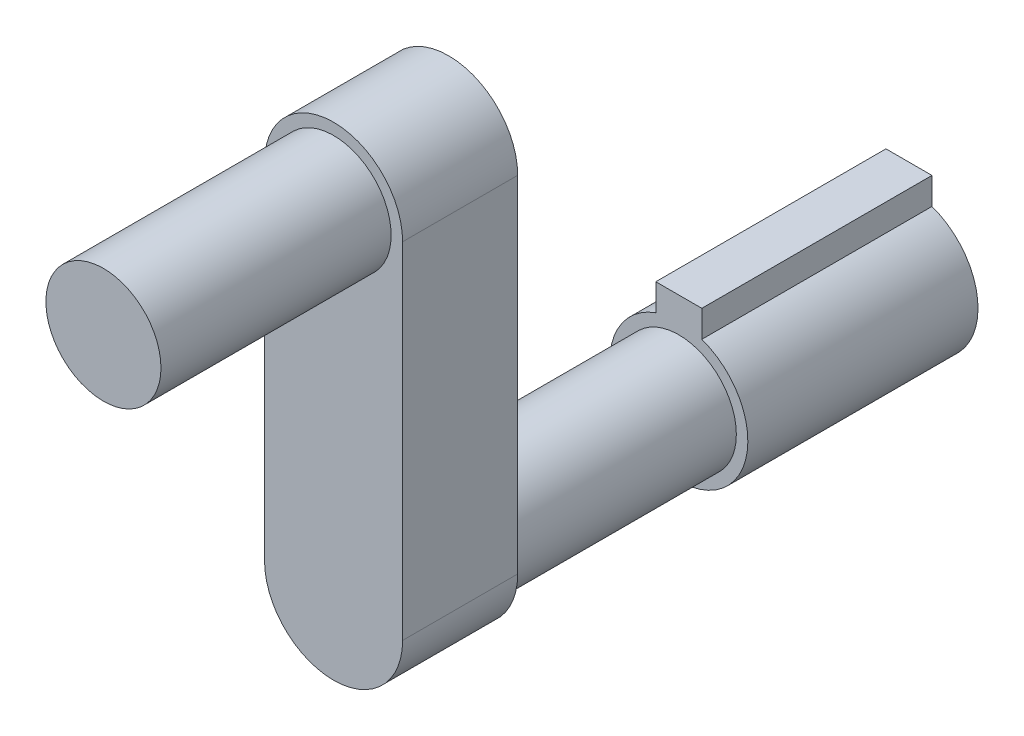
ISO-10303-21;
HEADER;
FILE_DESCRIPTION(('STEP AP214'),'2;1');
FILE_NAME('part.step','',(''),(''),'','','');
FILE_SCHEMA(('AUTOMOTIVE_DESIGN { 1 0 10303 214 1 1 1 1 }'));
ENDSEC;
DATA;
#1=APPLICATION_CONTEXT('core data for automotive mechanical design processes');
#2=APPLICATION_PROTOCOL_DEFINITION('international standard','automotive_design',2000,#1);
#3=PRODUCT_CONTEXT('',#1,'mechanical');
#4=PRODUCT('Part','Part','',(#3));
#5=PRODUCT_RELATED_PRODUCT_CATEGORY('part','',(#4));
#6=PRODUCT_DEFINITION_FORMATION('','',#4);
#7=PRODUCT_DEFINITION_CONTEXT('part definition',#1,'design');
#8=PRODUCT_DEFINITION('design','',#6,#7);
#9=PRODUCT_DEFINITION_SHAPE('','',#8);
#10=(LENGTH_UNIT() NAMED_UNIT(*) SI_UNIT(.MILLI.,.METRE.));
#11=(NAMED_UNIT(*) PLANE_ANGLE_UNIT() SI_UNIT($,.RADIAN.));
#12=(NAMED_UNIT(*) SI_UNIT($,.STERADIAN.) SOLID_ANGLE_UNIT());
#13=UNCERTAINTY_MEASURE_WITH_UNIT(LENGTH_MEASURE(1.E-05),#10,'distance_accuracy_value','');
#14=(GEOMETRIC_REPRESENTATION_CONTEXT(3) GLOBAL_UNCERTAINTY_ASSIGNED_CONTEXT((#13)) GLOBAL_UNIT_ASSIGNED_CONTEXT((#10,
#11,#12)) REPRESENTATION_CONTEXT('',''));
#15=CARTESIAN_POINT('',(0.,0.,0.));
#16=DIRECTION('',(0.,0.,1.));
#17=DIRECTION('',(1.,0.,0.));
#18=AXIS2_PLACEMENT_3D('',#15,#16,#17);
#19=CARTESIAN_POINT('',(0.,0.,0.));
#20=DIRECTION('',(0.,0.,1.));
#21=DIRECTION('',(1.,0.,0.));
#22=AXIS2_PLACEMENT_3D('',#19,#20,#21);
#23=PLANE('',#22);
#24=CARTESIAN_POINT('',(0.,0.,0.));
#25=DIRECTION('',(0.,0.,1.));
#26=DIRECTION('',(1.,0.,0.));
#27=AXIS2_PLACEMENT_3D('',#24,#25,#26);
#28=CIRCLE('',#27,3.);
#29=CARTESIAN_POINT('',(-1.,2.82842712474619,0.));
#30=VERTEX_POINT('',#29);
#31=CARTESIAN_POINT('',(1.,2.82842712474619,0.));
#32=VERTEX_POINT('',#31);
#33=EDGE_CURVE('E97',#30,#32,#28,.T.);
#34=ORIENTED_EDGE('',*,*,#33,.F.);
#35=DIRECTION('',(0.,1.,0.));
#36=VECTOR('',#35,1.);
#37=CARTESIAN_POINT('',(-1.,0.,0.));
#38=LINE('',#37,#36);
#39=CARTESIAN_POINT('',(-1.,3.99679871897497,0.));
#40=VERTEX_POINT('',#39);
#41=EDGE_CURVE('E202',#30,#40,#38,.T.);
#42=ORIENTED_EDGE('',*,*,#41,.T.);
#43=DIRECTION('',(-1.,0.,0.));
#44=VECTOR('',#43,1.);
#45=CARTESIAN_POINT('',(0.,3.99679871897497,0.));
#46=LINE('',#45,#44);
#47=CARTESIAN_POINT('',(1.,3.99679871897497,0.));
#48=VERTEX_POINT('',#47);
#49=EDGE_CURVE('E208',#48,#40,#46,.T.);
#50=ORIENTED_EDGE('',*,*,#49,.F.);
#51=DIRECTION('',(0.,1.,0.));
#52=VECTOR('',#51,1.);
#53=CARTESIAN_POINT('',(1.,0.,0.));
#54=LINE('',#53,#52);
#55=EDGE_CURVE('E206',#32,#48,#54,.T.);
#56=ORIENTED_EDGE('',*,*,#55,.F.);
#57=EDGE_LOOP('',(#34,#42,#50,#56));
#58=FACE_BOUND('',#57,.T.);
#59=ADVANCED_FACE('F93',(#58),#23,.F.);
#60=CARTESIAN_POINT('',(0.,3.99679871897497,10.));
#61=DIRECTION('',(0.,-1.,0.));
#62=DIRECTION('',(0.,0.,-1.));
#63=AXIS2_PLACEMENT_3D('',#60,#61,#62);
#64=PLANE('',#63);
#65=ORIENTED_EDGE('',*,*,#49,.T.);
#66=DIRECTION('',(0.,0.,-1.));
#67=VECTOR('',#66,1.);
#68=CARTESIAN_POINT('',(-1.,3.99679871897497,10.));
#69=LINE('',#68,#67);
#70=CARTESIAN_POINT('',(-1.,3.99679871897497,10.));
#71=VERTEX_POINT('',#70);
#72=EDGE_CURVE('E127',#71,#40,#69,.T.);
#73=ORIENTED_EDGE('',*,*,#72,.F.);
#74=DIRECTION('',(-1.,0.,0.));
#75=VECTOR('',#74,1.);
#76=CARTESIAN_POINT('',(0.,3.99679871897497,10.));
#77=LINE('',#76,#75);
#78=CARTESIAN_POINT('',(1.,3.99679871897497,10.));
#79=VERTEX_POINT('',#78);
#80=EDGE_CURVE('E201',#79,#71,#77,.T.);
#81=ORIENTED_EDGE('',*,*,#80,.F.);
#82=DIRECTION('',(0.,0.,-1.));
#83=VECTOR('',#82,1.);
#84=CARTESIAN_POINT('',(1.,3.99679871897497,10.));
#85=LINE('',#84,#83);
#86=EDGE_CURVE('E103',#79,#48,#85,.T.);
#87=ORIENTED_EDGE('',*,*,#86,.T.);
#88=EDGE_LOOP('',(#65,#73,#81,#87));
#89=FACE_BOUND('',#88,.T.);
#90=ADVANCED_FACE('F227',(#89),#64,.F.);
#91=CARTESIAN_POINT('',(-1.,0.,10.));
#92=DIRECTION('',(-1.,0.,0.));
#93=DIRECTION('',(0.,0.,1.));
#94=AXIS2_PLACEMENT_3D('',#91,#92,#93);
#95=PLANE('',#94);
#96=ORIENTED_EDGE('',*,*,#41,.F.);
#97=DIRECTION('',(0.,0.,-1.));
#98=VECTOR('',#97,1.);
#99=CARTESIAN_POINT('',(-1.,2.82842712474619,10.));
#100=LINE('',#99,#98);
#101=CARTESIAN_POINT('',(-1.,2.82842712474619,10.));
#102=VERTEX_POINT('',#101);
#103=EDGE_CURVE('E112',#102,#30,#100,.T.);
#104=ORIENTED_EDGE('',*,*,#103,.F.);
#105=DIRECTION('',(0.,1.,0.));
#106=VECTOR('',#105,1.);
#107=CARTESIAN_POINT('',(-1.,0.,10.));
#108=LINE('',#107,#106);
#109=EDGE_CURVE('E204',#102,#71,#108,.T.);
#110=ORIENTED_EDGE('',*,*,#109,.T.);
#111=ORIENTED_EDGE('',*,*,#72,.T.);
#112=EDGE_LOOP('',(#96,#104,#110,#111));
#113=FACE_BOUND('',#112,.T.);
#114=ADVANCED_FACE('F229',(#113),#95,.T.);
#115=CARTESIAN_POINT('',(1.,0.,10.));
#116=DIRECTION('',(-1.,0.,0.));
#117=DIRECTION('',(0.,0.,1.));
#118=AXIS2_PLACEMENT_3D('',#115,#116,#117);
#119=PLANE('',#118);
#120=ORIENTED_EDGE('',*,*,#55,.T.);
#121=ORIENTED_EDGE('',*,*,#86,.F.);
#122=DIRECTION('',(0.,1.,0.));
#123=VECTOR('',#122,1.);
#124=CARTESIAN_POINT('',(1.,0.,10.));
#125=LINE('',#124,#123);
#126=CARTESIAN_POINT('',(1.,2.82842712474619,10.));
#127=VERTEX_POINT('',#126);
#128=EDGE_CURVE('E199',#127,#79,#125,.T.);
#129=ORIENTED_EDGE('',*,*,#128,.F.);
#130=DIRECTION('',(0.,0.,-1.));
#131=VECTOR('',#130,1.);
#132=CARTESIAN_POINT('',(1.,2.82842712474619,10.));
#133=LINE('',#132,#131);
#134=EDGE_CURVE('E12',#127,#32,#133,.T.);
#135=ORIENTED_EDGE('',*,*,#134,.T.);
#136=EDGE_LOOP('',(#120,#121,#129,#135));
#137=FACE_BOUND('',#136,.T.);
#138=ADVANCED_FACE('F224',(#137),#119,.F.);
#139=CARTESIAN_POINT('',(0.,0.,10.));
#140=DIRECTION('',(0.,0.,1.));
#141=DIRECTION('',(1.,0.,0.));
#142=AXIS2_PLACEMENT_3D('',#139,#140,#141);
#143=PLANE('',#142);
#144=CARTESIAN_POINT('',(0.,0.,10.));
#145=DIRECTION('',(0.,0.,1.));
#146=DIRECTION('',(1.,0.,0.));
#147=AXIS2_PLACEMENT_3D('',#144,#145,#146);
#148=CIRCLE('',#147,2.5);
#149=CARTESIAN_POINT('',(2.5,0.,10.));
#150=VERTEX_POINT('',#149);
#151=EDGE_CURVE('E188',#150,#150,#148,.T.);
#152=ORIENTED_EDGE('',*,*,#151,.F.);
#153=EDGE_LOOP('',(#152));
#154=FACE_BOUND('',#153,.T.);
#155=ORIENTED_EDGE('',*,*,#109,.F.);
#156=CARTESIAN_POINT('',(0.,0.,10.));
#157=DIRECTION('',(0.,0.,1.));
#158=DIRECTION('',(1.,0.,0.));
#159=AXIS2_PLACEMENT_3D('',#156,#157,#158);
#160=CIRCLE('',#159,3.);
#161=EDGE_CURVE('E209',#102,#127,#160,.T.);
#162=ORIENTED_EDGE('',*,*,#161,.T.);
#163=ORIENTED_EDGE('',*,*,#128,.T.);
#164=ORIENTED_EDGE('',*,*,#80,.T.);
#165=EDGE_LOOP('',(#155,#162,#163,#164));
#166=FACE_BOUND('',#165,.T.);
#167=ADVANCED_FACE('F228',(#154,#166),#143,.T.);
#168=CARTESIAN_POINT('',(0.,0.,10.));
#169=DIRECTION('',(0.,0.,-1.));
#170=DIRECTION('',(-1.,0.,0.));
#171=AXIS2_PLACEMENT_3D('',#168,#169,#170);
#172=CYLINDRICAL_SURFACE('',#171,3.);
#173=ORIENTED_EDGE('',*,*,#33,.T.);
#174=ORIENTED_EDGE('',*,*,#134,.F.);
#175=ORIENTED_EDGE('',*,*,#161,.F.);
#176=ORIENTED_EDGE('',*,*,#103,.T.);
#177=EDGE_LOOP('',(#173,#174,#175,#176));
#178=FACE_BOUND('',#177,.T.);
#179=ADVANCED_FACE('F95',(#178),#172,.T.);
#180=CARTESIAN_POINT('',(0.,0.,20.));
#181=DIRECTION('',(0.,0.,-1.));
#182=DIRECTION('',(-1.,0.,0.));
#183=AXIS2_PLACEMENT_3D('',#180,#181,#182);
#184=CYLINDRICAL_SURFACE('',#183,2.5);
#185=CARTESIAN_POINT('',(0.,0.,20.));
#186=DIRECTION('',(0.,0.,1.));
#187=DIRECTION('',(1.,0.,0.));
#188=AXIS2_PLACEMENT_3D('',#185,#186,#187);
#189=CIRCLE('',#188,2.5);
#190=CARTESIAN_POINT('',(2.5,0.,20.));
#191=VERTEX_POINT('',#190);
#192=EDGE_CURVE('E191',#191,#191,#189,.T.);
#193=ORIENTED_EDGE('',*,*,#192,.F.);
#194=EDGE_LOOP('',(#193));
#195=FACE_BOUND('',#194,.T.);
#196=ORIENTED_EDGE('',*,*,#151,.T.);
#197=EDGE_LOOP('',(#196));
#198=FACE_BOUND('',#197,.T.);
#199=ADVANCED_FACE('F239',(#195,#198),#184,.T.);
#200=CARTESIAN_POINT('',(0.,0.,25.));
#201=DIRECTION('',(0.,0.,-1.));
#202=DIRECTION('',(-1.,0.,0.));
#203=AXIS2_PLACEMENT_3D('',#200,#201,#202);
#204=CYLINDRICAL_SURFACE('',#203,3.);
#205=CARTESIAN_POINT('',(0.,0.,20.));
#206=DIRECTION('',(0.,0.,1.));
#207=DIRECTION('',(1.,0.,0.));
#208=AXIS2_PLACEMENT_3D('',#205,#206,#207);
#209=CIRCLE('',#208,3.);
#210=CARTESIAN_POINT('',(-3.,0.,20.));
#211=VERTEX_POINT('',#210);
#212=CARTESIAN_POINT('',(3.,0.,20.));
#213=VERTEX_POINT('',#212);
#214=EDGE_CURVE('E187',#211,#213,#209,.T.);
#215=ORIENTED_EDGE('',*,*,#214,.T.);
#216=DIRECTION('',(0.,0.,-1.));
#217=VECTOR('',#216,1.);
#218=CARTESIAN_POINT('',(3.,0.,25.));
#219=LINE('',#218,#217);
#220=CARTESIAN_POINT('',(3.,0.,25.));
#221=VERTEX_POINT('',#220);
#222=EDGE_CURVE('E167',#221,#213,#219,.T.);
#223=ORIENTED_EDGE('',*,*,#222,.F.);
#224=CARTESIAN_POINT('',(0.,0.,25.));
#225=DIRECTION('',(0.,0.,1.));
#226=DIRECTION('',(1.,0.,0.));
#227=AXIS2_PLACEMENT_3D('',#224,#225,#226);
#228=CIRCLE('',#227,3.);
#229=CARTESIAN_POINT('',(-3.,0.,25.));
#230=VERTEX_POINT('',#229);
#231=EDGE_CURVE('E174',#230,#221,#228,.T.);
#232=ORIENTED_EDGE('',*,*,#231,.F.);
#233=DIRECTION('',(0.,0.,-1.));
#234=VECTOR('',#233,1.);
#235=CARTESIAN_POINT('',(-3.,0.,25.));
#236=LINE('',#235,#234);
#237=EDGE_CURVE('E289',#230,#211,#236,.T.);
#238=ORIENTED_EDGE('',*,*,#237,.T.);
#239=EDGE_LOOP('',(#215,#223,#232,#238));
#240=FACE_BOUND('',#239,.T.);
#241=ADVANCED_FACE('F185',(#240),#204,.T.);
#242=CARTESIAN_POINT('',(3.,0.,25.));
#243=DIRECTION('',(-1.,0.,0.));
#244=DIRECTION('',(0.,0.,1.));
#245=AXIS2_PLACEMENT_3D('',#242,#243,#244);
#246=PLANE('',#245);
#247=DIRECTION('',(0.,1.,0.));
#248=VECTOR('',#247,1.);
#249=CARTESIAN_POINT('',(3.,0.,20.));
#250=LINE('',#249,#248);
#251=CARTESIAN_POINT('',(3.,15.,20.));
#252=VERTEX_POINT('',#251);
#253=EDGE_CURVE('E283',#213,#252,#250,.T.);
#254=ORIENTED_EDGE('',*,*,#253,.T.);
#255=DIRECTION('',(0.,0.,-1.));
#256=VECTOR('',#255,1.);
#257=CARTESIAN_POINT('',(3.,15.,25.));
#258=LINE('',#257,#256);
#259=CARTESIAN_POINT('',(3.,15.,25.));
#260=VERTEX_POINT('',#259);
#261=EDGE_CURVE('E170',#260,#252,#258,.T.);
#262=ORIENTED_EDGE('',*,*,#261,.F.);
#263=DIRECTION('',(0.,1.,0.));
#264=VECTOR('',#263,1.);
#265=CARTESIAN_POINT('',(3.,0.,25.));
#266=LINE('',#265,#264);
#267=EDGE_CURVE('E163',#221,#260,#266,.T.);
#268=ORIENTED_EDGE('',*,*,#267,.F.);
#269=ORIENTED_EDGE('',*,*,#222,.T.);
#270=EDGE_LOOP('',(#254,#262,#268,#269));
#271=FACE_BOUND('',#270,.T.);
#272=ADVANCED_FACE('F165',(#271),#246,.F.);
#273=CARTESIAN_POINT('',(0.,15.,25.));
#274=DIRECTION('',(0.,0.,-1.));
#275=DIRECTION('',(-1.,0.,0.));
#276=AXIS2_PLACEMENT_3D('',#273,#274,#275);
#277=CYLINDRICAL_SURFACE('',#276,3.);
#278=CARTESIAN_POINT('',(0.,15.,20.));
#279=DIRECTION('',(0.,0.,1.));
#280=DIRECTION('',(1.,0.,0.));
#281=AXIS2_PLACEMENT_3D('',#278,#279,#280);
#282=CIRCLE('',#281,3.);
#283=CARTESIAN_POINT('',(-3.,15.,20.));
#284=VERTEX_POINT('',#283);
#285=EDGE_CURVE('E292',#252,#284,#282,.T.);
#286=ORIENTED_EDGE('',*,*,#285,.T.);
#287=DIRECTION('',(0.,0.,-1.));
#288=VECTOR('',#287,1.);
#289=CARTESIAN_POINT('',(-3.,15.,25.));
#290=LINE('',#289,#288);
#291=CARTESIAN_POINT('',(-3.,15.,25.));
#292=VERTEX_POINT('',#291);
#293=EDGE_CURVE('E193',#292,#284,#290,.T.);
#294=ORIENTED_EDGE('',*,*,#293,.F.);
#295=CARTESIAN_POINT('',(0.,15.,25.));
#296=DIRECTION('',(0.,0.,1.));
#297=DIRECTION('',(1.,0.,0.));
#298=AXIS2_PLACEMENT_3D('',#295,#296,#297);
#299=CIRCLE('',#298,3.);
#300=EDGE_CURVE('E173',#260,#292,#299,.T.);
#301=ORIENTED_EDGE('',*,*,#300,.F.);
#302=ORIENTED_EDGE('',*,*,#261,.T.);
#303=EDGE_LOOP('',(#286,#294,#301,#302));
#304=FACE_BOUND('',#303,.T.);
#305=ADVANCED_FACE('F254',(#304),#277,.T.);
#306=CARTESIAN_POINT('',(-3.,0.,25.));
#307=DIRECTION('',(1.,0.,0.));
#308=DIRECTION('',(0.,0.,-1.));
#309=AXIS2_PLACEMENT_3D('',#306,#307,#308);
#310=PLANE('',#309);
#311=DIRECTION('',(0.,-1.,0.));
#312=VECTOR('',#311,1.);
#313=CARTESIAN_POINT('',(-3.,0.,20.));
#314=LINE('',#313,#312);
#315=EDGE_CURVE('E183',#284,#211,#314,.T.);
#316=ORIENTED_EDGE('',*,*,#315,.T.);
#317=ORIENTED_EDGE('',*,*,#237,.F.);
#318=DIRECTION('',(0.,-1.,0.));
#319=VECTOR('',#318,1.);
#320=CARTESIAN_POINT('',(-3.,0.,25.));
#321=LINE('',#320,#319);
#322=EDGE_CURVE('E179',#292,#230,#321,.T.);
#323=ORIENTED_EDGE('',*,*,#322,.F.);
#324=ORIENTED_EDGE('',*,*,#293,.T.);
#325=EDGE_LOOP('',(#316,#317,#323,#324));
#326=FACE_BOUND('',#325,.T.);
#327=ADVANCED_FACE('F257',(#326),#310,.F.);
#328=CARTESIAN_POINT('',(0.,0.,25.));
#329=DIRECTION('',(0.,0.,1.));
#330=DIRECTION('',(1.,0.,0.));
#331=AXIS2_PLACEMENT_3D('',#328,#329,#330);
#332=PLANE('',#331);
#333=CARTESIAN_POINT('',(0.,15.,25.));
#334=DIRECTION('',(0.,0.,1.));
#335=DIRECTION('',(1.,0.,0.));
#336=AXIS2_PLACEMENT_3D('',#333,#334,#335);
#337=CIRCLE('',#336,2.5);
#338=CARTESIAN_POINT('',(2.5,15.,25.));
#339=VERTEX_POINT('',#338);
#340=EDGE_CURVE('E281',#339,#339,#337,.T.);
#341=ORIENTED_EDGE('',*,*,#340,.F.);
#342=EDGE_LOOP('',(#341));
#343=FACE_BOUND('',#342,.T.);
#344=ORIENTED_EDGE('',*,*,#231,.T.);
#345=ORIENTED_EDGE('',*,*,#267,.T.);
#346=ORIENTED_EDGE('',*,*,#300,.T.);
#347=ORIENTED_EDGE('',*,*,#322,.T.);
#348=EDGE_LOOP('',(#344,#345,#346,#347));
#349=FACE_BOUND('',#348,.T.);
#350=ADVANCED_FACE('F177',(#343,#349),#332,.T.);
#351=CARTESIAN_POINT('',(0.,0.,20.));
#352=DIRECTION('',(0.,0.,1.));
#353=DIRECTION('',(1.,0.,0.));
#354=AXIS2_PLACEMENT_3D('',#351,#352,#353);
#355=PLANE('',#354);
#356=ORIENTED_EDGE('',*,*,#192,.T.);
#357=EDGE_LOOP('',(#356));
#358=FACE_BOUND('',#357,.T.);
#359=ORIENTED_EDGE('',*,*,#214,.F.);
#360=ORIENTED_EDGE('',*,*,#315,.F.);
#361=ORIENTED_EDGE('',*,*,#285,.F.);
#362=ORIENTED_EDGE('',*,*,#253,.F.);
#363=EDGE_LOOP('',(#359,#360,#361,#362));
#364=FACE_BOUND('',#363,.T.);
#365=ADVANCED_FACE('F262',(#358,#364),#355,.F.);
#366=CARTESIAN_POINT('',(0.,15.,35.));
#367=DIRECTION('',(0.,0.,-1.));
#368=DIRECTION('',(-1.,0.,0.));
#369=AXIS2_PLACEMENT_3D('',#366,#367,#368);
#370=CYLINDRICAL_SURFACE('',#369,2.5);
#371=CARTESIAN_POINT('',(0.,15.,35.));
#372=DIRECTION('',(0.,0.,1.));
#373=DIRECTION('',(1.,0.,0.));
#374=AXIS2_PLACEMENT_3D('',#371,#372,#373);
#375=CIRCLE('',#374,2.5);
#376=CARTESIAN_POINT('',(2.5,15.,35.));
#377=VERTEX_POINT('',#376);
#378=EDGE_CURVE('E280',#377,#377,#375,.T.);
#379=ORIENTED_EDGE('',*,*,#378,.F.);
#380=EDGE_LOOP('',(#379));
#381=FACE_BOUND('',#380,.T.);
#382=ORIENTED_EDGE('',*,*,#340,.T.);
#383=EDGE_LOOP('',(#382));
#384=FACE_BOUND('',#383,.T.);
#385=ADVANCED_FACE('F265',(#381,#384),#370,.T.);
#386=CARTESIAN_POINT('',(0.,15.,35.));
#387=DIRECTION('',(0.,0.,1.));
#388=DIRECTION('',(1.,0.,0.));
#389=AXIS2_PLACEMENT_3D('',#386,#387,#388);
#390=PLANE('',#389);
#391=ORIENTED_EDGE('',*,*,#378,.T.);
#392=EDGE_LOOP('',(#391));
#393=FACE_BOUND('',#392,.T.);
#394=ADVANCED_FACE('F272',(#393),#390,.T.);
#395=CLOSED_SHELL('',(#59,#90,#114,#138,#167,#179,#199,#241,#272,#305,#327,#350,#365,#385,#394));
#396=MANIFOLD_SOLID_BREP('B2',#395);
#397=ADVANCED_BREP_SHAPE_REPRESENTATION('',(#18,#396),#14);
#398=SHAPE_DEFINITION_REPRESENTATION(#9,#397);
ENDSEC;
END-ISO-10303-21;
